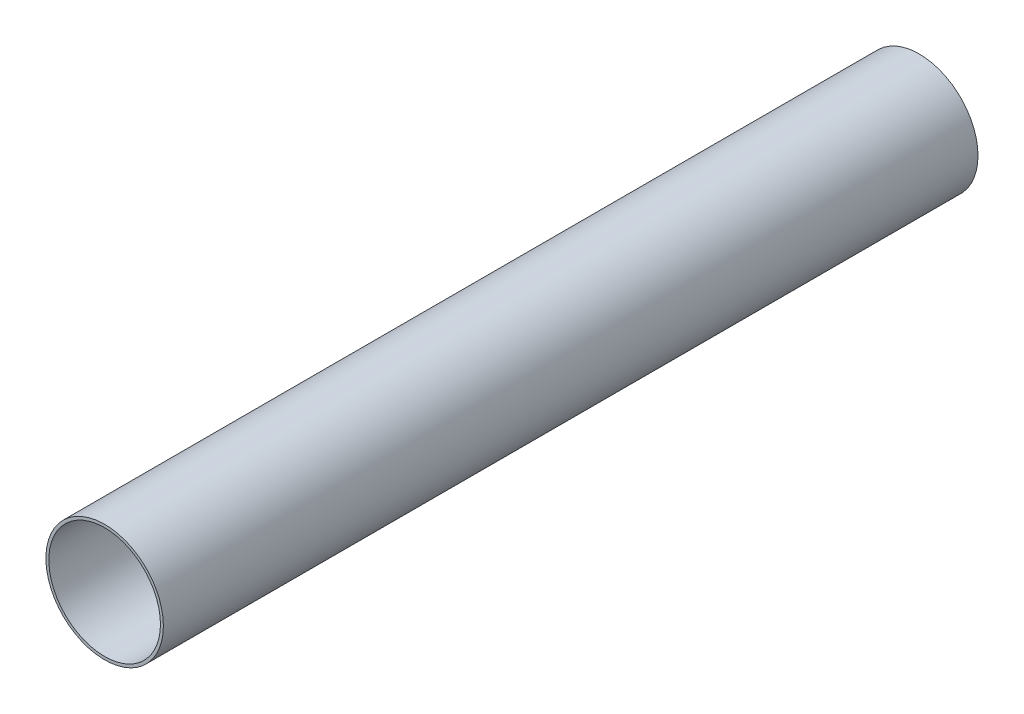
ISO-10303-21;
HEADER;
FILE_DESCRIPTION(('STEP AP214'),'2;1');
FILE_NAME('part.step','',(''),(''),'','','');
FILE_SCHEMA(('AUTOMOTIVE_DESIGN { 1 0 10303 214 1 1 1 1 }'));
ENDSEC;
DATA;
#1=APPLICATION_CONTEXT('core data for automotive mechanical design processes');
#2=APPLICATION_PROTOCOL_DEFINITION('international standard','automotive_design',2000,#1);
#3=PRODUCT_CONTEXT('',#1,'mechanical');
#4=PRODUCT('Part','Part','',(#3));
#5=PRODUCT_RELATED_PRODUCT_CATEGORY('part','',(#4));
#6=PRODUCT_DEFINITION_FORMATION('','',#4);
#7=PRODUCT_DEFINITION_CONTEXT('part definition',#1,'design');
#8=PRODUCT_DEFINITION('design','',#6,#7);
#9=PRODUCT_DEFINITION_SHAPE('','',#8);
#10=(LENGTH_UNIT() NAMED_UNIT(*) SI_UNIT(.MILLI.,.METRE.));
#11=(NAMED_UNIT(*) PLANE_ANGLE_UNIT() SI_UNIT($,.RADIAN.));
#12=(NAMED_UNIT(*) SI_UNIT($,.STERADIAN.) SOLID_ANGLE_UNIT());
#13=UNCERTAINTY_MEASURE_WITH_UNIT(LENGTH_MEASURE(1.E-05),#10,'distance_accuracy_value','');
#14=(GEOMETRIC_REPRESENTATION_CONTEXT(3) GLOBAL_UNCERTAINTY_ASSIGNED_CONTEXT((#13)) GLOBAL_UNIT_ASSIGNED_CONTEXT((#10,
#11,#12)) REPRESENTATION_CONTEXT('',''));
#15=CARTESIAN_POINT('',(0.,0.,0.));
#16=DIRECTION('',(0.,0.,1.));
#17=DIRECTION('',(1.,0.,0.));
#18=AXIS2_PLACEMENT_3D('',#15,#16,#17);
#19=CARTESIAN_POINT('',(0.,0.,211.7));
#20=DIRECTION('',(0.,0.,1.));
#21=DIRECTION('',(1.,0.,0.));
#22=AXIS2_PLACEMENT_3D('',#19,#20,#21);
#23=PLANE('',#22);
#24=CARTESIAN_POINT('',(0.,0.,211.7));
#25=DIRECTION('',(0.,0.,1.));
#26=DIRECTION('',(1.,0.,0.));
#27=AXIS2_PLACEMENT_3D('',#24,#25,#26);
#28=CIRCLE('',#27,15.265);
#29=CARTESIAN_POINT('',(15.265,0.,211.7));
#30=VERTEX_POINT('',#29);
#31=EDGE_CURVE('E10',#30,#30,#28,.T.);
#32=ORIENTED_EDGE('',*,*,#31,.T.);
#33=EDGE_LOOP('',(#32));
#34=FACE_BOUND('',#33,.T.);
#35=CARTESIAN_POINT('',(0.,0.,211.7));
#36=DIRECTION('',(0.,0.,1.));
#37=DIRECTION('',(1.,0.,0.));
#38=AXIS2_PLACEMENT_3D('',#35,#36,#37);
#39=CIRCLE('',#38,14.505);
#40=CARTESIAN_POINT('',(14.505,0.,211.7));
#41=VERTEX_POINT('',#40);
#42=EDGE_CURVE('E48',#41,#41,#39,.T.);
#43=ORIENTED_EDGE('',*,*,#42,.F.);
#44=EDGE_LOOP('',(#43));
#45=FACE_BOUND('',#44,.T.);
#46=ADVANCED_FACE('F37',(#34,#45),#23,.T.);
#47=CARTESIAN_POINT('',(0.,0.,0.));
#48=DIRECTION('',(0.,0.,1.));
#49=DIRECTION('',(1.,0.,0.));
#50=AXIS2_PLACEMENT_3D('',#47,#48,#49);
#51=PLANE('',#50);
#52=CARTESIAN_POINT('',(0.,0.,0.));
#53=DIRECTION('',(0.,0.,1.));
#54=DIRECTION('',(1.,0.,0.));
#55=AXIS2_PLACEMENT_3D('',#52,#53,#54);
#56=CIRCLE('',#55,15.265);
#57=CARTESIAN_POINT('',(15.265,0.,0.));
#58=VERTEX_POINT('',#57);
#59=EDGE_CURVE('E41',#58,#58,#56,.T.);
#60=ORIENTED_EDGE('',*,*,#59,.F.);
#61=EDGE_LOOP('',(#60));
#62=FACE_BOUND('',#61,.T.);
#63=CARTESIAN_POINT('',(0.,0.,0.));
#64=DIRECTION('',(0.,0.,1.));
#65=DIRECTION('',(1.,0.,0.));
#66=AXIS2_PLACEMENT_3D('',#63,#64,#65);
#67=CIRCLE('',#66,14.505);
#68=CARTESIAN_POINT('',(14.505,0.,0.));
#69=VERTEX_POINT('',#68);
#70=EDGE_CURVE('E50',#69,#69,#67,.T.);
#71=ORIENTED_EDGE('',*,*,#70,.T.);
#72=EDGE_LOOP('',(#71));
#73=FACE_BOUND('',#72,.T.);
#74=ADVANCED_FACE('F60',(#62,#73),#51,.F.);
#75=CARTESIAN_POINT('',(0.,0.,211.7));
#76=DIRECTION('',(0.,0.,-1.));
#77=DIRECTION('',(-1.,0.,0.));
#78=AXIS2_PLACEMENT_3D('',#75,#76,#77);
#79=CYLINDRICAL_SURFACE('',#78,15.265);
#80=ORIENTED_EDGE('',*,*,#31,.F.);
#81=EDGE_LOOP('',(#80));
#82=FACE_BOUND('',#81,.T.);
#83=ORIENTED_EDGE('',*,*,#59,.T.);
#84=EDGE_LOOP('',(#83));
#85=FACE_BOUND('',#84,.T.);
#86=ADVANCED_FACE('F39',(#82,#85),#79,.T.);
#87=CARTESIAN_POINT('',(0.,0.,211.7));
#88=DIRECTION('',(0.,0.,-1.));
#89=DIRECTION('',(-1.,0.,0.));
#90=AXIS2_PLACEMENT_3D('',#87,#88,#89);
#91=CYLINDRICAL_SURFACE('',#90,14.505);
#92=ORIENTED_EDGE('',*,*,#42,.T.);
#93=EDGE_LOOP('',(#92));
#94=FACE_BOUND('',#93,.T.);
#95=ORIENTED_EDGE('',*,*,#70,.F.);
#96=EDGE_LOOP('',(#95));
#97=FACE_BOUND('',#96,.T.);
#98=ADVANCED_FACE('F56',(#94,#97),#91,.F.);
#99=CLOSED_SHELL('',(#46,#74,#86,#98));
#100=MANIFOLD_SOLID_BREP('B2',#99);
#101=ADVANCED_BREP_SHAPE_REPRESENTATION('',(#18,#100),#14);
#102=SHAPE_DEFINITION_REPRESENTATION(#9,#101);
ENDSEC;
END-ISO-10303-21;
